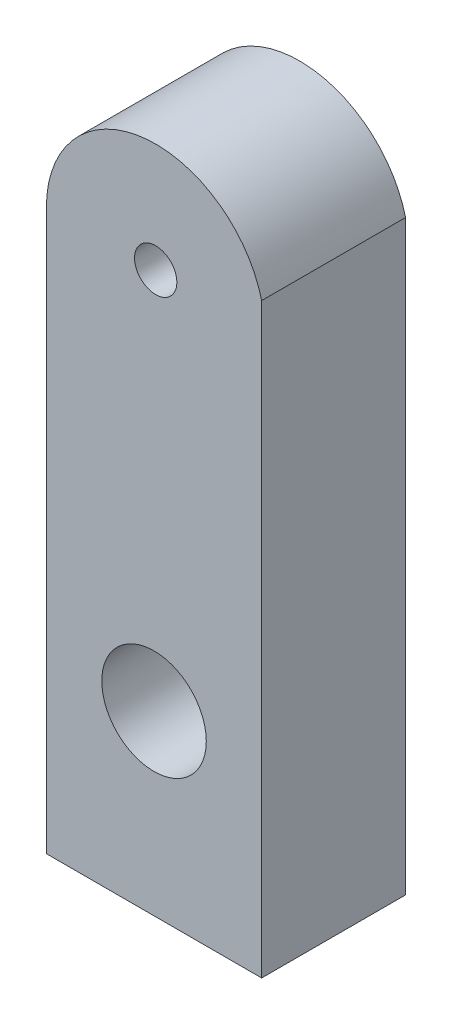
ISO-10303-21;
HEADER;
FILE_DESCRIPTION(('STEP AP214'),'2;1');
FILE_NAME('part.step','',(''),(''),'','','');
FILE_SCHEMA(('AUTOMOTIVE_DESIGN { 1 0 10303 214 1 1 1 1 }'));
ENDSEC;
DATA;
#1=APPLICATION_CONTEXT('core data for automotive mechanical design processes');
#2=APPLICATION_PROTOCOL_DEFINITION('international standard','automotive_design',2000,#1);
#3=PRODUCT_CONTEXT('',#1,'mechanical');
#4=PRODUCT('Part','Part','',(#3));
#5=PRODUCT_RELATED_PRODUCT_CATEGORY('part','',(#4));
#6=PRODUCT_DEFINITION_FORMATION('','',#4);
#7=PRODUCT_DEFINITION_CONTEXT('part definition',#1,'design');
#8=PRODUCT_DEFINITION('design','',#6,#7);
#9=PRODUCT_DEFINITION_SHAPE('','',#8);
#10=(LENGTH_UNIT() NAMED_UNIT(*) SI_UNIT(.MILLI.,.METRE.));
#11=(NAMED_UNIT(*) PLANE_ANGLE_UNIT() SI_UNIT($,.RADIAN.));
#12=(NAMED_UNIT(*) SI_UNIT($,.STERADIAN.) SOLID_ANGLE_UNIT());
#13=UNCERTAINTY_MEASURE_WITH_UNIT(LENGTH_MEASURE(1.E-05),#10,'distance_accuracy_value','');
#14=(GEOMETRIC_REPRESENTATION_CONTEXT(3) GLOBAL_UNCERTAINTY_ASSIGNED_CONTEXT((#13)) GLOBAL_UNIT_ASSIGNED_CONTEXT((#10,
#11,#12)) REPRESENTATION_CONTEXT('',''));
#15=CARTESIAN_POINT('',(0.,0.,0.));
#16=DIRECTION('',(0.,0.,1.));
#17=DIRECTION('',(1.,0.,0.));
#18=AXIS2_PLACEMENT_3D('',#15,#16,#17);
#19=CARTESIAN_POINT('',(12.5178119557569,3.14555116298819,100.046491829537));
#20=DIRECTION('',(-1.,0.,0.));
#21=DIRECTION('',(0.,-1.,0.));
#22=AXIS2_PLACEMENT_3D('',#19,#20,#21);
#23=PLANE('',#22);
#24=DIRECTION('',(0.,1.,0.));
#25=VECTOR('',#24,1.);
#26=CARTESIAN_POINT('',(12.5178119557569,3.14555116298819,17.0000000000001));
#27=LINE('',#26,#25);
#28=CARTESIAN_POINT('',(12.5178119557569,-66.1518585764595,17.0000000000001));
#29=VERTEX_POINT('',#28);
#30=CARTESIAN_POINT('',(12.5178119557569,3.14555116298819,17.0000000000001));
#31=VERTEX_POINT('',#30);
#32=EDGE_CURVE('E79',#29,#31,#27,.T.);
#33=ORIENTED_EDGE('',*,*,#32,.F.);
#34=DIRECTION('',(0.,0.,-1.));
#35=VECTOR('',#34,1.);
#36=CARTESIAN_POINT('',(12.5178119557569,-66.1518585764595,100.046491829537));
#37=LINE('',#36,#35);
#38=CARTESIAN_POINT('',(12.5178119557569,-66.1518585764595,0.));
#39=VERTEX_POINT('',#38);
#40=EDGE_CURVE('E51',#29,#39,#37,.T.);
#41=ORIENTED_EDGE('',*,*,#40,.T.);
#42=DIRECTION('',(0.,1.,0.));
#43=VECTOR('',#42,1.);
#44=CARTESIAN_POINT('',(12.5178119557569,3.14555116298819,0.));
#45=LINE('',#44,#43);
#46=CARTESIAN_POINT('',(12.5178119557569,3.14555116298819,0.));
#47=VERTEX_POINT('',#46);
#48=EDGE_CURVE('E82',#39,#47,#45,.T.);
#49=ORIENTED_EDGE('',*,*,#48,.T.);
#50=DIRECTION('',(0.,0.,-1.));
#51=VECTOR('',#50,1.);
#52=CARTESIAN_POINT('',(12.5178119557569,3.14555116298819,100.046491829537));
#53=LINE('',#52,#51);
#54=EDGE_CURVE('E76',#31,#47,#53,.T.);
#55=ORIENTED_EDGE('',*,*,#54,.F.);
#56=EDGE_LOOP('',(#33,#41,#49,#55));
#57=FACE_BOUND('',#56,.T.);
#58=ADVANCED_FACE('F35',(#57),#23,.F.);
#59=CARTESIAN_POINT('',(-12.9069790531582,-66.1518585764595,100.046491829537));
#60=DIRECTION('',(0.,1.,0.));
#61=DIRECTION('',(0.,0.,1.));
#62=AXIS2_PLACEMENT_3D('',#59,#60,#61);
#63=PLANE('',#62);
#64=DIRECTION('',(1.,0.,0.));
#65=VECTOR('',#64,1.);
#66=CARTESIAN_POINT('',(-12.9069790531582,-66.1518585764595,17.0000000000001));
#67=LINE('',#66,#65);
#68=CARTESIAN_POINT('',(-12.9069790531582,-66.1518585764595,17.0000000000001));
#69=VERTEX_POINT('',#68);
#70=EDGE_CURVE('E93',#69,#29,#67,.T.);
#71=ORIENTED_EDGE('',*,*,#70,.F.);
#72=DIRECTION('',(0.,0.,-1.));
#73=VECTOR('',#72,1.);
#74=CARTESIAN_POINT('',(-12.9069790531582,-66.1518585764595,100.046491829537));
#75=LINE('',#74,#73);
#76=CARTESIAN_POINT('',(-12.9069790531582,-66.1518585764595,0.));
#77=VERTEX_POINT('',#76);
#78=EDGE_CURVE('E44',#69,#77,#75,.T.);
#79=ORIENTED_EDGE('',*,*,#78,.T.);
#80=DIRECTION('',(1.,0.,0.));
#81=VECTOR('',#80,1.);
#82=CARTESIAN_POINT('',(-12.9069790531582,-66.1518585764595,0.));
#83=LINE('',#82,#81);
#84=EDGE_CURVE('E111',#77,#39,#83,.T.);
#85=ORIENTED_EDGE('',*,*,#84,.T.);
#86=ORIENTED_EDGE('',*,*,#40,.F.);
#87=EDGE_LOOP('',(#71,#79,#85,#86));
#88=FACE_BOUND('',#87,.T.);
#89=ADVANCED_FACE('F115',(#88),#63,.F.);
#90=CARTESIAN_POINT('',(-12.9069790531583,0.,100.046491829537));
#91=DIRECTION('',(1.,0.,0.));
#92=DIRECTION('',(0.,1.,0.));
#93=AXIS2_PLACEMENT_3D('',#90,#91,#92);
#94=PLANE('',#93);
#95=DIRECTION('',(0.,-1.,0.));
#96=VECTOR('',#95,1.);
#97=CARTESIAN_POINT('',(-12.9069790531583,0.,17.0000000000001));
#98=LINE('',#97,#96);
#99=CARTESIAN_POINT('',(-12.9069790531583,0.,17.0000000000001));
#100=VERTEX_POINT('',#99);
#101=EDGE_CURVE('E58',#100,#69,#98,.T.);
#102=ORIENTED_EDGE('',*,*,#101,.F.);
#103=DIRECTION('',(0.,0.,-1.));
#104=VECTOR('',#103,1.);
#105=CARTESIAN_POINT('',(-12.9069790531583,0.,100.046491829537));
#106=LINE('',#105,#104);
#107=CARTESIAN_POINT('',(-12.9069790531583,0.,0.));
#108=VERTEX_POINT('',#107);
#109=EDGE_CURVE('E11',#100,#108,#106,.T.);
#110=ORIENTED_EDGE('',*,*,#109,.T.);
#111=DIRECTION('',(0.,-1.,0.));
#112=VECTOR('',#111,1.);
#113=CARTESIAN_POINT('',(-12.9069790531583,0.,0.));
#114=LINE('',#113,#112);
#115=EDGE_CURVE('E108',#108,#77,#114,.T.);
#116=ORIENTED_EDGE('',*,*,#115,.T.);
#117=ORIENTED_EDGE('',*,*,#78,.F.);
#118=EDGE_LOOP('',(#102,#110,#116,#117));
#119=FACE_BOUND('',#118,.T.);
#120=ADVANCED_FACE('F118',(#119),#94,.F.);
#121=CARTESIAN_POINT('',(0.,0.,100.046491829537));
#122=DIRECTION('',(0.,0.,-1.));
#123=DIRECTION('',(-1.,0.,0.));
#124=AXIS2_PLACEMENT_3D('',#121,#122,#123);
#125=CYLINDRICAL_SURFACE('',#124,12.9069790531583);
#126=CARTESIAN_POINT('',(0.,0.,17.0000000000001));
#127=DIRECTION('',(0.,0.,1.));
#128=DIRECTION('',(1.,0.,0.));
#129=AXIS2_PLACEMENT_3D('',#126,#127,#128);
#130=CIRCLE('',#129,12.9069790531583);
#131=EDGE_CURVE('E88',#31,#100,#130,.T.);
#132=ORIENTED_EDGE('',*,*,#131,.F.);
#133=ORIENTED_EDGE('',*,*,#54,.T.);
#134=CARTESIAN_POINT('',(0.,0.,0.));
#135=DIRECTION('',(0.,0.,1.));
#136=DIRECTION('',(1.,0.,0.));
#137=AXIS2_PLACEMENT_3D('',#134,#135,#136);
#138=CIRCLE('',#137,12.9069790531583);
#139=EDGE_CURVE('E106',#47,#108,#138,.T.);
#140=ORIENTED_EDGE('',*,*,#139,.T.);
#141=ORIENTED_EDGE('',*,*,#109,.F.);
#142=EDGE_LOOP('',(#132,#133,#140,#141));
#143=FACE_BOUND('',#142,.T.);
#144=ADVANCED_FACE('F37',(#143),#125,.T.);
#145=CARTESIAN_POINT('',(0.,0.,100.046491829537));
#146=DIRECTION('',(0.,0.,-1.));
#147=DIRECTION('',(-1.,0.,0.));
#148=AXIS2_PLACEMENT_3D('',#145,#146,#147);
#149=CYLINDRICAL_SURFACE('',#148,2.5);
#150=CARTESIAN_POINT('',(0.,0.,0.));
#151=DIRECTION('',(0.,0.,1.));
#152=DIRECTION('',(1.,0.,0.));
#153=AXIS2_PLACEMENT_3D('',#150,#151,#152);
#154=CIRCLE('',#153,2.5);
#155=CARTESIAN_POINT('',(2.5,0.,0.));
#156=VERTEX_POINT('',#155);
#157=EDGE_CURVE('E103',#156,#156,#154,.T.);
#158=ORIENTED_EDGE('',*,*,#157,.F.);
#159=EDGE_LOOP('',(#158));
#160=FACE_BOUND('',#159,.T.);
#161=CARTESIAN_POINT('',(0.,0.,17.0000000000001));
#162=DIRECTION('',(0.,0.,1.));
#163=DIRECTION('',(1.,0.,0.));
#164=AXIS2_PLACEMENT_3D('',#161,#162,#163);
#165=CIRCLE('',#164,2.5);
#166=CARTESIAN_POINT('',(2.5,0.,17.0000000000001));
#167=VERTEX_POINT('',#166);
#168=EDGE_CURVE('E94',#167,#167,#165,.T.);
#169=ORIENTED_EDGE('',*,*,#168,.T.);
#170=EDGE_LOOP('',(#169));
#171=FACE_BOUND('',#170,.T.);
#172=ADVANCED_FACE('F124',(#160,#171),#149,.F.);
#173=CARTESIAN_POINT('',(0.,0.,0.));
#174=DIRECTION('',(0.,0.,1.));
#175=DIRECTION('',(1.,0.,0.));
#176=AXIS2_PLACEMENT_3D('',#173,#174,#175);
#177=PLANE('',#176);
#178=ORIENTED_EDGE('',*,*,#157,.T.);
#179=EDGE_LOOP('',(#178));
#180=FACE_BOUND('',#179,.T.);
#181=ORIENTED_EDGE('',*,*,#139,.F.);
#182=ORIENTED_EDGE('',*,*,#48,.F.);
#183=ORIENTED_EDGE('',*,*,#84,.F.);
#184=ORIENTED_EDGE('',*,*,#115,.F.);
#185=EDGE_LOOP('',(#181,#182,#183,#184));
#186=FACE_BOUND('',#185,.T.);
#187=CARTESIAN_POINT('',(-0.194583548700693,-45.2140468353589,0.));
#188=DIRECTION('',(0.,0.,1.));
#189=DIRECTION('',(1.,0.,0.));
#190=AXIS2_PLACEMENT_3D('',#187,#188,#189);
#191=CIRCLE('',#190,6.17179632287384);
#192=CARTESIAN_POINT('',(5.97721277417315,-45.2140468353589,0.));
#193=VERTEX_POINT('',#192);
#194=EDGE_CURVE('E90',#193,#193,#191,.T.);
#195=ORIENTED_EDGE('',*,*,#194,.T.);
#196=EDGE_LOOP('',(#195));
#197=FACE_BOUND('',#196,.T.);
#198=ADVANCED_FACE('F120',(#180,#186,#197),#177,.F.);
#199=CARTESIAN_POINT('',(-0.194583548700693,-45.2140468353589,100.046491829537));
#200=DIRECTION('',(0.,0.,-1.));
#201=DIRECTION('',(-1.,0.,0.));
#202=AXIS2_PLACEMENT_3D('',#199,#200,#201);
#203=CYLINDRICAL_SURFACE('',#202,6.17179632287384);
#204=ORIENTED_EDGE('',*,*,#194,.F.);
#205=EDGE_LOOP('',(#204));
#206=FACE_BOUND('',#205,.T.);
#207=CARTESIAN_POINT('',(-0.194583548700693,-45.2140468353589,17.0000000000001));
#208=DIRECTION('',(0.,0.,1.));
#209=DIRECTION('',(1.,0.,0.));
#210=AXIS2_PLACEMENT_3D('',#207,#208,#209);
#211=CIRCLE('',#210,6.17179632287384);
#212=CARTESIAN_POINT('',(5.97721277417315,-45.2140468353589,17.0000000000001));
#213=VERTEX_POINT('',#212);
#214=EDGE_CURVE('E39',#213,#213,#211,.T.);
#215=ORIENTED_EDGE('',*,*,#214,.T.);
#216=EDGE_LOOP('',(#215));
#217=FACE_BOUND('',#216,.T.);
#218=ADVANCED_FACE('F123',(#206,#217),#203,.F.);
#219=CARTESIAN_POINT('',(0.,0.,17.0000000000001));
#220=DIRECTION('',(0.,0.,1.));
#221=DIRECTION('',(0.959123326490256,-0.282988417752857,0.));
#222=AXIS2_PLACEMENT_3D('',#219,#220,#221);
#223=PLANE('',#222);
#224=ORIENTED_EDGE('',*,*,#214,.F.);
#225=EDGE_LOOP('',(#224));
#226=FACE_BOUND('',#225,.T.);
#227=ORIENTED_EDGE('',*,*,#168,.F.);
#228=EDGE_LOOP('',(#227));
#229=FACE_BOUND('',#228,.T.);
#230=ORIENTED_EDGE('',*,*,#32,.T.);
#231=ORIENTED_EDGE('',*,*,#131,.T.);
#232=ORIENTED_EDGE('',*,*,#101,.T.);
#233=ORIENTED_EDGE('',*,*,#70,.T.);
#234=EDGE_LOOP('',(#230,#231,#232,#233));
#235=FACE_BOUND('',#234,.T.);
#236=ADVANCED_FACE('F92',(#226,#229,#235),#223,.T.);
#237=CLOSED_SHELL('',(#58,#89,#120,#144,#172,#198,#218,#236));
#238=MANIFOLD_SOLID_BREP('B2',#237);
#239=ADVANCED_BREP_SHAPE_REPRESENTATION('',(#18,#238),#14);
#240=SHAPE_DEFINITION_REPRESENTATION(#9,#239);
ENDSEC;
END-ISO-10303-21;
